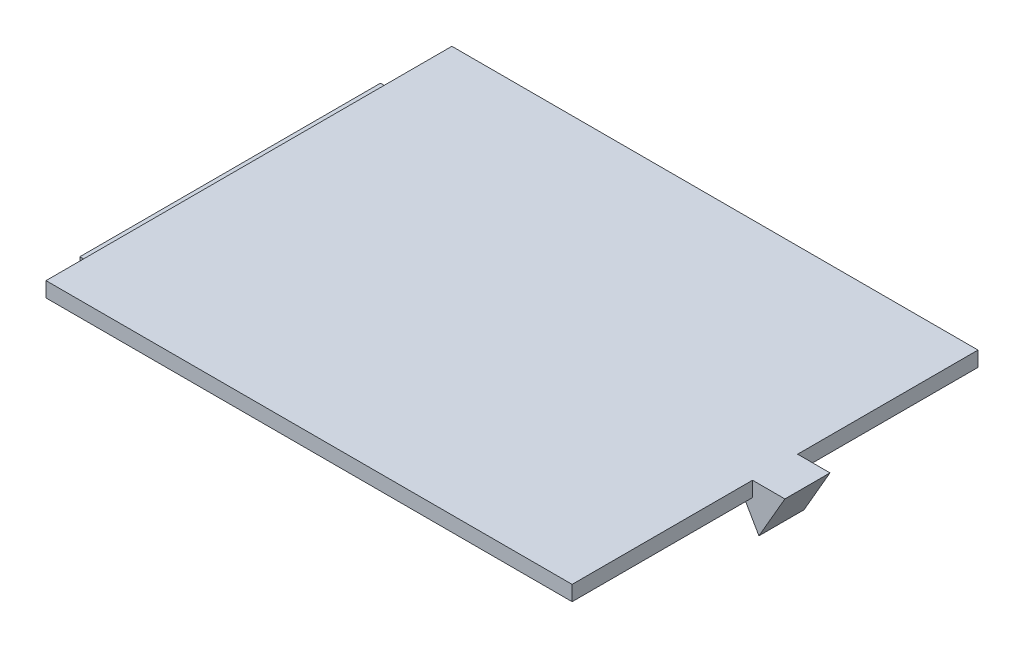
ISO-10303-21;
HEADER;
FILE_DESCRIPTION(('STEP AP214'),'2;1');
FILE_NAME('part.step','',(''),(''),'','','');
FILE_SCHEMA(('AUTOMOTIVE_DESIGN { 1 0 10303 214 1 1 1 1 }'));
ENDSEC;
DATA;
#1=APPLICATION_CONTEXT('core data for automotive mechanical design processes');
#2=APPLICATION_PROTOCOL_DEFINITION('international standard','automotive_design',2000,#1);
#3=PRODUCT_CONTEXT('',#1,'mechanical');
#4=PRODUCT('Part','Part','',(#3));
#5=PRODUCT_RELATED_PRODUCT_CATEGORY('part','',(#4));
#6=PRODUCT_DEFINITION_FORMATION('','',#4);
#7=PRODUCT_DEFINITION_CONTEXT('part definition',#1,'design');
#8=PRODUCT_DEFINITION('design','',#6,#7);
#9=PRODUCT_DEFINITION_SHAPE('','',#8);
#10=(LENGTH_UNIT() NAMED_UNIT(*) SI_UNIT(.MILLI.,.METRE.));
#11=(NAMED_UNIT(*) PLANE_ANGLE_UNIT() SI_UNIT($,.RADIAN.));
#12=(NAMED_UNIT(*) SI_UNIT($,.STERADIAN.) SOLID_ANGLE_UNIT());
#13=UNCERTAINTY_MEASURE_WITH_UNIT(LENGTH_MEASURE(1.E-05),#10,'distance_accuracy_value','');
#14=(GEOMETRIC_REPRESENTATION_CONTEXT(3) GLOBAL_UNCERTAINTY_ASSIGNED_CONTEXT((#13)) GLOBAL_UNIT_ASSIGNED_CONTEXT((#10,
#11,#12)) REPRESENTATION_CONTEXT('',''));
#15=CARTESIAN_POINT('',(0.,0.,0.));
#16=DIRECTION('',(0.,0.,1.));
#17=DIRECTION('',(1.,0.,0.));
#18=AXIS2_PLACEMENT_3D('',#15,#16,#17);
#19=CARTESIAN_POINT('',(35.,2.,27.));
#20=DIRECTION('',(-1.,0.,0.));
#21=DIRECTION('',(0.,0.,1.));
#22=AXIS2_PLACEMENT_3D('',#19,#20,#21);
#23=PLANE('',#22);
#24=DIRECTION('',(0.,1.,0.));
#25=VECTOR('',#24,1.);
#26=CARTESIAN_POINT('',(35.,2.,-2.99999999999999));
#27=LINE('',#26,#25);
#28=CARTESIAN_POINT('',(35.,0.,-2.99999999999999));
#29=VERTEX_POINT('',#28);
#30=CARTESIAN_POINT('',(35.,2.,-2.99999999999999));
#31=VERTEX_POINT('',#30);
#32=EDGE_CURVE('E185',#29,#31,#27,.T.);
#33=ORIENTED_EDGE('',*,*,#32,.F.);
#34=DIRECTION('',(0.,0.,-1.));
#35=VECTOR('',#34,1.);
#36=CARTESIAN_POINT('',(35.,0.,27.));
#37=LINE('',#36,#35);
#38=CARTESIAN_POINT('',(35.,0.,-27.));
#39=VERTEX_POINT('',#38);
#40=EDGE_CURVE('E234',#29,#39,#37,.T.);
#41=ORIENTED_EDGE('',*,*,#40,.T.);
#42=DIRECTION('',(0.,-1.,0.));
#43=VECTOR('',#42,1.);
#44=CARTESIAN_POINT('',(35.,2.,-27.));
#45=LINE('',#44,#43);
#46=CARTESIAN_POINT('',(35.,2.,-27.));
#47=VERTEX_POINT('',#46);
#48=EDGE_CURVE('E274',#47,#39,#45,.T.);
#49=ORIENTED_EDGE('',*,*,#48,.F.);
#50=DIRECTION('',(0.,0.,-1.));
#51=VECTOR('',#50,1.);
#52=CARTESIAN_POINT('',(35.,2.,27.));
#53=LINE('',#52,#51);
#54=EDGE_CURVE('E55',#31,#47,#53,.T.);
#55=ORIENTED_EDGE('',*,*,#54,.F.);
#56=EDGE_LOOP('',(#33,#41,#49,#55));
#57=FACE_BOUND('',#56,.T.);
#58=ADVANCED_FACE('F39',(#57),#23,.F.);
#59=CARTESIAN_POINT('',(0.,0.,0.));
#60=DIRECTION('',(0.,-1.,0.));
#61=DIRECTION('',(0.,0.,-1.));
#62=AXIS2_PLACEMENT_3D('',#59,#60,#61);
#63=PLANE('',#62);
#64=ORIENTED_EDGE('',*,*,#40,.F.);
#65=DIRECTION('',(-1.,0.,0.));
#66=VECTOR('',#65,1.);
#67=CARTESIAN_POINT('',(0.,0.,-2.99999999999999));
#68=LINE('',#67,#66);
#69=CARTESIAN_POINT('',(33.5558668010512,0.,-2.99999999999999));
#70=VERTEX_POINT('',#69);
#71=EDGE_CURVE('E11',#29,#70,#68,.T.);
#72=ORIENTED_EDGE('',*,*,#71,.T.);
#73=DIRECTION('',(0.,0.,-1.));
#74=VECTOR('',#73,1.);
#75=CARTESIAN_POINT('',(33.5558668010512,0.,0.));
#76=LINE('',#75,#74);
#77=CARTESIAN_POINT('',(33.5558668010512,0.,3.00000000000001));
#78=VERTEX_POINT('',#77);
#79=EDGE_CURVE('E48',#78,#70,#76,.T.);
#80=ORIENTED_EDGE('',*,*,#79,.F.);
#81=DIRECTION('',(-1.,0.,0.));
#82=VECTOR('',#81,1.);
#83=CARTESIAN_POINT('',(0.,0.,3.00000000000001));
#84=LINE('',#83,#82);
#85=CARTESIAN_POINT('',(35.,0.,3.00000000000001));
#86=VERTEX_POINT('',#85);
#87=EDGE_CURVE('E278',#86,#78,#84,.T.);
#88=ORIENTED_EDGE('',*,*,#87,.F.);
#89=CARTESIAN_POINT('',(35.,0.,27.));
#90=VERTEX_POINT('',#89);
#91=EDGE_CURVE('E248',#90,#86,#37,.T.);
#92=ORIENTED_EDGE('',*,*,#91,.F.);
#93=DIRECTION('',(1.,0.,0.));
#94=VECTOR('',#93,1.);
#95=CARTESIAN_POINT('',(-35.,0.,27.));
#96=LINE('',#95,#94);
#97=CARTESIAN_POINT('',(-35.,0.,27.));
#98=VERTEX_POINT('',#97);
#99=EDGE_CURVE('E259',#98,#90,#96,.T.);
#100=ORIENTED_EDGE('',*,*,#99,.F.);
#101=DIRECTION('',(0.,0.,1.));
#102=VECTOR('',#101,1.);
#103=CARTESIAN_POINT('',(-35.,0.,27.));
#104=LINE('',#103,#102);
#105=CARTESIAN_POINT('',(-35.,0.,20.));
#106=VERTEX_POINT('',#105);
#107=EDGE_CURVE('E254',#106,#98,#104,.T.);
#108=ORIENTED_EDGE('',*,*,#107,.F.);
#109=DIRECTION('',(-1.,0.,0.));
#110=VECTOR('',#109,1.);
#111=CARTESIAN_POINT('',(-37.5,0.,20.));
#112=LINE('',#111,#110);
#113=CARTESIAN_POINT('',(-32.5,0.,20.));
#114=VERTEX_POINT('',#113);
#115=EDGE_CURVE('E208',#114,#106,#112,.T.);
#116=ORIENTED_EDGE('',*,*,#115,.F.);
#117=DIRECTION('',(0.,0.,1.));
#118=VECTOR('',#117,1.);
#119=CARTESIAN_POINT('',(-32.5,0.,-20.));
#120=LINE('',#119,#118);
#121=CARTESIAN_POINT('',(-32.5,0.,-20.));
#122=VERTEX_POINT('',#121);
#123=EDGE_CURVE('E188',#122,#114,#120,.T.);
#124=ORIENTED_EDGE('',*,*,#123,.F.);
#125=DIRECTION('',(1.,0.,0.));
#126=VECTOR('',#125,1.);
#127=CARTESIAN_POINT('',(-37.5,0.,-20.));
#128=LINE('',#127,#126);
#129=CARTESIAN_POINT('',(-35.,0.,-20.));
#130=VERTEX_POINT('',#129);
#131=EDGE_CURVE('E218',#130,#122,#128,.T.);
#132=ORIENTED_EDGE('',*,*,#131,.F.);
#133=CARTESIAN_POINT('',(-35.,0.,-27.));
#134=VERTEX_POINT('',#133);
#135=EDGE_CURVE('E255',#134,#130,#104,.T.);
#136=ORIENTED_EDGE('',*,*,#135,.F.);
#137=DIRECTION('',(-1.,0.,0.));
#138=VECTOR('',#137,1.);
#139=CARTESIAN_POINT('',(-35.,0.,-27.));
#140=LINE('',#139,#138);
#141=EDGE_CURVE('E251',#39,#134,#140,.T.);
#142=ORIENTED_EDGE('',*,*,#141,.F.);
#143=EDGE_LOOP('',(#64,#72,#80,#88,#92,#100,#108,#116,#124,#132,#136,#142));
#144=FACE_BOUND('',#143,.T.);
#145=ADVANCED_FACE('F314',(#144),#63,.T.);
#146=ORIENTED_EDGE('',*,*,#91,.T.);
#147=DIRECTION('',(0.,1.,0.));
#148=VECTOR('',#147,1.);
#149=CARTESIAN_POINT('',(35.,2.,3.00000000000001));
#150=LINE('',#149,#148);
#151=CARTESIAN_POINT('',(35.,2.,3.00000000000001));
#152=VERTEX_POINT('',#151);
#153=EDGE_CURVE('E63',#86,#152,#150,.T.);
#154=ORIENTED_EDGE('',*,*,#153,.T.);
#155=CARTESIAN_POINT('',(35.,2.,27.));
#156=VERTEX_POINT('',#155);
#157=EDGE_CURVE('E235',#156,#152,#53,.T.);
#158=ORIENTED_EDGE('',*,*,#157,.F.);
#159=DIRECTION('',(0.,-1.,0.));
#160=VECTOR('',#159,1.);
#161=CARTESIAN_POINT('',(35.,2.,27.));
#162=LINE('',#161,#160);
#163=EDGE_CURVE('E247',#156,#90,#162,.T.);
#164=ORIENTED_EDGE('',*,*,#163,.T.);
#165=EDGE_LOOP('',(#146,#154,#158,#164));
#166=FACE_BOUND('',#165,.T.);
#167=ADVANCED_FACE('F41',(#166),#23,.F.);
#168=CARTESIAN_POINT('',(-35.,2.,-27.));
#169=DIRECTION('',(0.,0.,1.));
#170=DIRECTION('',(1.,0.,0.));
#171=AXIS2_PLACEMENT_3D('',#168,#169,#170);
#172=PLANE('',#171);
#173=ORIENTED_EDGE('',*,*,#141,.T.);
#174=DIRECTION('',(0.,-1.,0.));
#175=VECTOR('',#174,1.);
#176=CARTESIAN_POINT('',(-35.,2.,-27.));
#177=LINE('',#176,#175);
#178=CARTESIAN_POINT('',(-35.,2.,-27.));
#179=VERTEX_POINT('',#178);
#180=EDGE_CURVE('E270',#179,#134,#177,.T.);
#181=ORIENTED_EDGE('',*,*,#180,.F.);
#182=DIRECTION('',(-1.,0.,0.));
#183=VECTOR('',#182,1.);
#184=CARTESIAN_POINT('',(-35.,2.,-27.));
#185=LINE('',#184,#183);
#186=EDGE_CURVE('E238',#47,#179,#185,.T.);
#187=ORIENTED_EDGE('',*,*,#186,.F.);
#188=ORIENTED_EDGE('',*,*,#48,.T.);
#189=EDGE_LOOP('',(#173,#181,#187,#188));
#190=FACE_BOUND('',#189,.T.);
#191=ADVANCED_FACE('F334',(#190),#172,.F.);
#192=CARTESIAN_POINT('',(-35.,2.,27.));
#193=DIRECTION('',(1.,0.,0.));
#194=DIRECTION('',(0.,0.,-1.));
#195=AXIS2_PLACEMENT_3D('',#192,#193,#194);
#196=PLANE('',#195);
#197=ORIENTED_EDGE('',*,*,#135,.T.);
#198=EDGE_CURVE('E260',#130,#106,#104,.T.);
#199=ORIENTED_EDGE('',*,*,#198,.T.);
#200=ORIENTED_EDGE('',*,*,#107,.T.);
#201=DIRECTION('',(0.,-1.,0.));
#202=VECTOR('',#201,1.);
#203=CARTESIAN_POINT('',(-35.,2.,27.));
#204=LINE('',#203,#202);
#205=CARTESIAN_POINT('',(-35.,2.,27.));
#206=VERTEX_POINT('',#205);
#207=EDGE_CURVE('E266',#206,#98,#204,.T.);
#208=ORIENTED_EDGE('',*,*,#207,.F.);
#209=DIRECTION('',(0.,0.,1.));
#210=VECTOR('',#209,1.);
#211=CARTESIAN_POINT('',(-35.,2.,27.));
#212=LINE('',#211,#210);
#213=EDGE_CURVE('E241',#179,#206,#212,.T.);
#214=ORIENTED_EDGE('',*,*,#213,.F.);
#215=ORIENTED_EDGE('',*,*,#180,.T.);
#216=EDGE_LOOP('',(#197,#199,#200,#208,#214,#215));
#217=FACE_BOUND('',#216,.T.);
#218=ADVANCED_FACE('F321',(#217),#196,.F.);
#219=CARTESIAN_POINT('',(-35.,2.,27.));
#220=DIRECTION('',(0.,0.,-1.));
#221=DIRECTION('',(-1.,0.,0.));
#222=AXIS2_PLACEMENT_3D('',#219,#220,#221);
#223=PLANE('',#222);
#224=ORIENTED_EDGE('',*,*,#99,.T.);
#225=ORIENTED_EDGE('',*,*,#163,.F.);
#226=DIRECTION('',(1.,0.,0.));
#227=VECTOR('',#226,1.);
#228=CARTESIAN_POINT('',(-35.,2.,27.));
#229=LINE('',#228,#227);
#230=EDGE_CURVE('E244',#206,#156,#229,.T.);
#231=ORIENTED_EDGE('',*,*,#230,.F.);
#232=ORIENTED_EDGE('',*,*,#207,.T.);
#233=EDGE_LOOP('',(#224,#225,#231,#232));
#234=FACE_BOUND('',#233,.T.);
#235=ADVANCED_FACE('F325',(#234),#223,.F.);
#236=CARTESIAN_POINT('',(0.,2.,0.));
#237=DIRECTION('',(0.,-1.,0.));
#238=DIRECTION('',(0.,0.,-1.));
#239=AXIS2_PLACEMENT_3D('',#236,#237,#238);
#240=PLANE('',#239);
#241=ORIENTED_EDGE('',*,*,#157,.T.);
#242=DIRECTION('',(-1.,0.,0.));
#243=VECTOR('',#242,1.);
#244=CARTESIAN_POINT('',(39.3079994767361,2.,3.00000000000001));
#245=LINE('',#244,#243);
#246=CARTESIAN_POINT('',(39.3079994767361,2.,3.00000000000001));
#247=VERTEX_POINT('',#246);
#248=EDGE_CURVE('E154',#247,#152,#245,.T.);
#249=ORIENTED_EDGE('',*,*,#248,.F.);
#250=DIRECTION('',(0.,0.,1.));
#251=VECTOR('',#250,1.);
#252=CARTESIAN_POINT('',(39.3079994767361,2.,-2.99999999999999));
#253=LINE('',#252,#251);
#254=CARTESIAN_POINT('',(39.3079994767361,2.,-2.99999999999999));
#255=VERTEX_POINT('',#254);
#256=EDGE_CURVE('E163',#255,#247,#253,.T.);
#257=ORIENTED_EDGE('',*,*,#256,.F.);
#258=DIRECTION('',(-1.,0.,0.));
#259=VECTOR('',#258,1.);
#260=CARTESIAN_POINT('',(39.3079994767361,2.,-2.99999999999999));
#261=LINE('',#260,#259);
#262=EDGE_CURVE('E164',#255,#31,#261,.T.);
#263=ORIENTED_EDGE('',*,*,#262,.T.);
#264=ORIENTED_EDGE('',*,*,#54,.T.);
#265=ORIENTED_EDGE('',*,*,#186,.T.);
#266=ORIENTED_EDGE('',*,*,#213,.T.);
#267=ORIENTED_EDGE('',*,*,#230,.T.);
#268=EDGE_LOOP('',(#241,#249,#257,#263,#264,#265,#266,#267));
#269=FACE_BOUND('',#268,.T.);
#270=ADVANCED_FACE('F328',(#269),#240,.F.);
#271=CARTESIAN_POINT('',(0.,0.,0.));
#272=DIRECTION('',(0.,1.,0.));
#273=DIRECTION('',(0.,0.,1.));
#274=AXIS2_PLACEMENT_3D('',#271,#272,#273);
#275=PLANE('',#274);
#276=ORIENTED_EDGE('',*,*,#198,.F.);
#277=CARTESIAN_POINT('',(-37.5,0.,-20.));
#278=VERTEX_POINT('',#277);
#279=EDGE_CURVE('E194',#278,#130,#128,.T.);
#280=ORIENTED_EDGE('',*,*,#279,.F.);
#281=DIRECTION('',(0.,0.,-1.));
#282=VECTOR('',#281,1.);
#283=CARTESIAN_POINT('',(-37.5,0.,-20.));
#284=LINE('',#283,#282);
#285=CARTESIAN_POINT('',(-37.5,0.,20.));
#286=VERTEX_POINT('',#285);
#287=EDGE_CURVE('E212',#286,#278,#284,.T.);
#288=ORIENTED_EDGE('',*,*,#287,.F.);
#289=EDGE_CURVE('E207',#106,#286,#112,.T.);
#290=ORIENTED_EDGE('',*,*,#289,.F.);
#291=EDGE_LOOP('',(#276,#280,#288,#290));
#292=FACE_BOUND('',#291,.T.);
#293=ADVANCED_FACE('F301',(#292),#275,.T.);
#294=CARTESIAN_POINT('',(-32.5,-1.,-20.));
#295=DIRECTION('',(-1.,0.,0.));
#296=DIRECTION('',(0.,0.,1.));
#297=AXIS2_PLACEMENT_3D('',#294,#295,#296);
#298=PLANE('',#297);
#299=ORIENTED_EDGE('',*,*,#123,.T.);
#300=DIRECTION('',(0.,1.,0.));
#301=VECTOR('',#300,1.);
#302=CARTESIAN_POINT('',(-32.5,-1.,20.));
#303=LINE('',#302,#301);
#304=CARTESIAN_POINT('',(-32.5,-1.,20.));
#305=VERTEX_POINT('',#304);
#306=EDGE_CURVE('E230',#305,#114,#303,.T.);
#307=ORIENTED_EDGE('',*,*,#306,.F.);
#308=DIRECTION('',(0.,0.,1.));
#309=VECTOR('',#308,1.);
#310=CARTESIAN_POINT('',(-32.5,-1.,-20.));
#311=LINE('',#310,#309);
#312=CARTESIAN_POINT('',(-32.5,-1.,-20.));
#313=VERTEX_POINT('',#312);
#314=EDGE_CURVE('E189',#313,#305,#311,.T.);
#315=ORIENTED_EDGE('',*,*,#314,.F.);
#316=DIRECTION('',(0.,1.,0.));
#317=VECTOR('',#316,1.);
#318=CARTESIAN_POINT('',(-32.5,-1.,-20.));
#319=LINE('',#318,#317);
#320=EDGE_CURVE('E203',#313,#122,#319,.T.);
#321=ORIENTED_EDGE('',*,*,#320,.T.);
#322=EDGE_LOOP('',(#299,#307,#315,#321));
#323=FACE_BOUND('',#322,.T.);
#324=ADVANCED_FACE('F311',(#323),#298,.F.);
#325=CARTESIAN_POINT('',(-37.5,-1.,20.));
#326=DIRECTION('',(0.,0.,-1.));
#327=DIRECTION('',(-1.,0.,0.));
#328=AXIS2_PLACEMENT_3D('',#325,#326,#327);
#329=PLANE('',#328);
#330=ORIENTED_EDGE('',*,*,#115,.T.);
#331=ORIENTED_EDGE('',*,*,#289,.T.);
#332=DIRECTION('',(0.,1.,0.));
#333=VECTOR('',#332,1.);
#334=CARTESIAN_POINT('',(-37.5,-1.,20.));
#335=LINE('',#334,#333);
#336=CARTESIAN_POINT('',(-37.5,-1.,20.));
#337=VERTEX_POINT('',#336);
#338=EDGE_CURVE('E226',#337,#286,#335,.T.);
#339=ORIENTED_EDGE('',*,*,#338,.F.);
#340=DIRECTION('',(-1.,0.,0.));
#341=VECTOR('',#340,1.);
#342=CARTESIAN_POINT('',(-37.5,-1.,20.));
#343=LINE('',#342,#341);
#344=EDGE_CURVE('E193',#305,#337,#343,.T.);
#345=ORIENTED_EDGE('',*,*,#344,.F.);
#346=ORIENTED_EDGE('',*,*,#306,.T.);
#347=EDGE_LOOP('',(#330,#331,#339,#345,#346));
#348=FACE_BOUND('',#347,.T.);
#349=ADVANCED_FACE('F292',(#348),#329,.F.);
#350=CARTESIAN_POINT('',(-37.5,-1.,-20.));
#351=DIRECTION('',(1.,0.,0.));
#352=DIRECTION('',(0.,0.,-1.));
#353=AXIS2_PLACEMENT_3D('',#350,#351,#352);
#354=PLANE('',#353);
#355=ORIENTED_EDGE('',*,*,#287,.T.);
#356=DIRECTION('',(0.,1.,0.));
#357=VECTOR('',#356,1.);
#358=CARTESIAN_POINT('',(-37.5,-1.,-20.));
#359=LINE('',#358,#357);
#360=CARTESIAN_POINT('',(-37.5,-1.,-20.));
#361=VERTEX_POINT('',#360);
#362=EDGE_CURVE('E222',#361,#278,#359,.T.);
#363=ORIENTED_EDGE('',*,*,#362,.F.);
#364=DIRECTION('',(0.,0.,-1.));
#365=VECTOR('',#364,1.);
#366=CARTESIAN_POINT('',(-37.5,-1.,-20.));
#367=LINE('',#366,#365);
#368=EDGE_CURVE('E197',#337,#361,#367,.T.);
#369=ORIENTED_EDGE('',*,*,#368,.F.);
#370=ORIENTED_EDGE('',*,*,#338,.T.);
#371=EDGE_LOOP('',(#355,#363,#369,#370));
#372=FACE_BOUND('',#371,.T.);
#373=ADVANCED_FACE('F298',(#372),#354,.F.);
#374=CARTESIAN_POINT('',(-37.5,-1.,-20.));
#375=DIRECTION('',(0.,0.,1.));
#376=DIRECTION('',(1.,0.,0.));
#377=AXIS2_PLACEMENT_3D('',#374,#375,#376);
#378=PLANE('',#377);
#379=ORIENTED_EDGE('',*,*,#279,.T.);
#380=ORIENTED_EDGE('',*,*,#131,.T.);
#381=ORIENTED_EDGE('',*,*,#320,.F.);
#382=DIRECTION('',(1.,0.,0.));
#383=VECTOR('',#382,1.);
#384=CARTESIAN_POINT('',(-37.5,-1.,-20.));
#385=LINE('',#384,#383);
#386=EDGE_CURVE('E200',#361,#313,#385,.T.);
#387=ORIENTED_EDGE('',*,*,#386,.F.);
#388=ORIENTED_EDGE('',*,*,#362,.T.);
#389=EDGE_LOOP('',(#379,#380,#381,#387,#388));
#390=FACE_BOUND('',#389,.T.);
#391=ADVANCED_FACE('F303',(#390),#378,.F.);
#392=CARTESIAN_POINT('',(0.,-1.,0.));
#393=DIRECTION('',(0.,1.,0.));
#394=DIRECTION('',(0.,0.,1.));
#395=AXIS2_PLACEMENT_3D('',#392,#393,#394);
#396=PLANE('',#395);
#397=ORIENTED_EDGE('',*,*,#314,.T.);
#398=ORIENTED_EDGE('',*,*,#344,.T.);
#399=ORIENTED_EDGE('',*,*,#368,.T.);
#400=ORIENTED_EDGE('',*,*,#386,.T.);
#401=EDGE_LOOP('',(#397,#398,#399,#400));
#402=FACE_BOUND('',#401,.T.);
#403=ADVANCED_FACE('F308',(#402),#396,.F.);
#404=CARTESIAN_POINT('',(0.,0.,-2.99999999999999));
#405=DIRECTION('',(0.,0.,1.));
#406=DIRECTION('',(1.,0.,0.));
#407=AXIS2_PLACEMENT_3D('',#404,#405,#406);
#408=PLANE('',#407);
#409=ORIENTED_EDGE('',*,*,#71,.F.);
#410=ORIENTED_EDGE('',*,*,#32,.T.);
#411=ORIENTED_EDGE('',*,*,#262,.F.);
#412=DIRECTION('',(0.500000000000001,0.866025403784438,0.));
#413=VECTOR('',#412,1.);
#414=CARTESIAN_POINT('',(35.854582869704,-3.98149302308165,-2.99999999999999));
#415=LINE('',#414,#413);
#416=CARTESIAN_POINT('',(35.854582869704,-3.98149302308165,-2.99999999999999));
#417=VERTEX_POINT('',#416);
#418=EDGE_CURVE('E153',#417,#255,#415,.T.);
#419=ORIENTED_EDGE('',*,*,#418,.F.);
#420=DIRECTION('',(0.500000000000001,-0.866025403784438,0.));
#421=VECTOR('',#420,1.);
#422=CARTESIAN_POINT('',(32.4011662626719,2.,-2.99999999999999));
#423=LINE('',#422,#421);
#424=EDGE_CURVE('E143',#70,#417,#423,.T.);
#425=ORIENTED_EDGE('',*,*,#424,.F.);
#426=EDGE_LOOP('',(#409,#410,#411,#419,#425));
#427=FACE_BOUND('',#426,.T.);
#428=ADVANCED_FACE('F166',(#427),#408,.F.);
#429=CARTESIAN_POINT('',(0.,0.,3.00000000000001));
#430=DIRECTION('',(0.,0.,1.));
#431=DIRECTION('',(1.,0.,0.));
#432=AXIS2_PLACEMENT_3D('',#429,#430,#431);
#433=PLANE('',#432);
#434=ORIENTED_EDGE('',*,*,#153,.F.);
#435=ORIENTED_EDGE('',*,*,#87,.T.);
#436=DIRECTION('',(0.500000000000001,-0.866025403784438,0.));
#437=VECTOR('',#436,1.);
#438=CARTESIAN_POINT('',(32.4011662626719,2.,3.00000000000001));
#439=LINE('',#438,#437);
#440=CARTESIAN_POINT('',(35.854582869704,-3.98149302308165,3.00000000000001));
#441=VERTEX_POINT('',#440);
#442=EDGE_CURVE('E173',#78,#441,#439,.T.);
#443=ORIENTED_EDGE('',*,*,#442,.T.);
#444=DIRECTION('',(0.500000000000001,0.866025403784438,0.));
#445=VECTOR('',#444,1.);
#446=CARTESIAN_POINT('',(35.854582869704,-3.98149302308165,3.00000000000001));
#447=LINE('',#446,#445);
#448=EDGE_CURVE('E161',#441,#247,#447,.T.);
#449=ORIENTED_EDGE('',*,*,#448,.T.);
#450=ORIENTED_EDGE('',*,*,#248,.T.);
#451=EDGE_LOOP('',(#434,#435,#443,#449,#450));
#452=FACE_BOUND('',#451,.T.);
#453=ADVANCED_FACE('F336',(#452),#433,.T.);
#454=CARTESIAN_POINT('',(32.4011662626719,2.,-2.99999999999999));
#455=DIRECTION('',(-0.866025403784438,-0.500000000000001,0.));
#456=DIRECTION('',(0.500000000000001,-0.866025403784438,0.));
#457=AXIS2_PLACEMENT_3D('',#454,#455,#456);
#458=PLANE('',#457);
#459=ORIENTED_EDGE('',*,*,#442,.F.);
#460=ORIENTED_EDGE('',*,*,#79,.T.);
#461=ORIENTED_EDGE('',*,*,#424,.T.);
#462=DIRECTION('',(0.,0.,1.));
#463=VECTOR('',#462,1.);
#464=CARTESIAN_POINT('',(35.854582869704,-3.98149302308165,-2.99999999999999));
#465=LINE('',#464,#463);
#466=EDGE_CURVE('E147',#417,#441,#465,.T.);
#467=ORIENTED_EDGE('',*,*,#466,.T.);
#468=EDGE_LOOP('',(#459,#460,#461,#467));
#469=FACE_BOUND('',#468,.T.);
#470=ADVANCED_FACE('F146',(#469),#458,.T.);
#471=CARTESIAN_POINT('',(35.854582869704,-3.98149302308165,-2.99999999999999));
#472=DIRECTION('',(0.866025403784438,-0.500000000000001,0.));
#473=DIRECTION('',(0.500000000000001,0.866025403784438,0.));
#474=AXIS2_PLACEMENT_3D('',#471,#472,#473);
#475=PLANE('',#474);
#476=ORIENTED_EDGE('',*,*,#448,.F.);
#477=ORIENTED_EDGE('',*,*,#466,.F.);
#478=ORIENTED_EDGE('',*,*,#418,.T.);
#479=ORIENTED_EDGE('',*,*,#256,.T.);
#480=EDGE_LOOP('',(#476,#477,#478,#479));
#481=FACE_BOUND('',#480,.T.);
#482=ADVANCED_FACE('F158',(#481),#475,.T.);
#483=CLOSED_SHELL('',(#58,#145,#167,#191,#218,#235,#270,#293,#324,#349,#373,#391,#403,#428,#453,
#470,#482));
#484=MANIFOLD_SOLID_BREP('B2',#483);
#485=ADVANCED_BREP_SHAPE_REPRESENTATION('',(#18,#484),#14);
#486=SHAPE_DEFINITION_REPRESENTATION(#9,#485);
ENDSEC;
END-ISO-10303-21;
